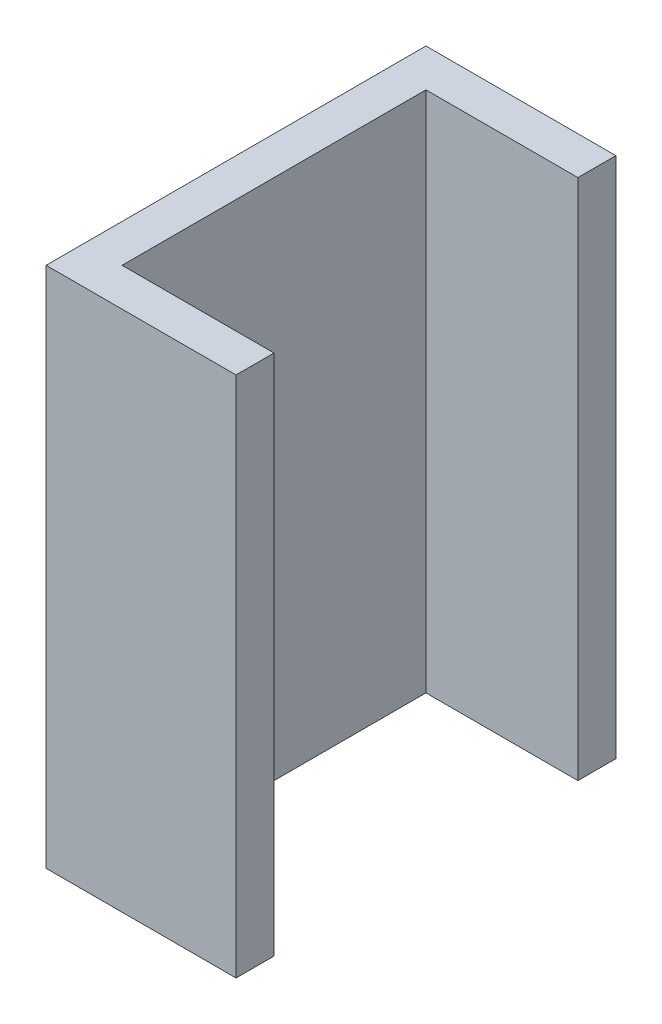
ISO-10303-21;
HEADER;
FILE_DESCRIPTION(('STEP AP214'),'2;1');
FILE_NAME('part.step','',(''),(''),'','','');
FILE_SCHEMA(('AUTOMOTIVE_DESIGN { 1 0 10303 214 1 1 1 1 }'));
ENDSEC;
DATA;
#1=APPLICATION_CONTEXT('core data for automotive mechanical design processes');
#2=APPLICATION_PROTOCOL_DEFINITION('international standard','automotive_design',2000,#1);
#3=PRODUCT_CONTEXT('',#1,'mechanical');
#4=PRODUCT('Part','Part','',(#3));
#5=PRODUCT_RELATED_PRODUCT_CATEGORY('part','',(#4));
#6=PRODUCT_DEFINITION_FORMATION('','',#4);
#7=PRODUCT_DEFINITION_CONTEXT('part definition',#1,'design');
#8=PRODUCT_DEFINITION('design','',#6,#7);
#9=PRODUCT_DEFINITION_SHAPE('','',#8);
#10=(LENGTH_UNIT() NAMED_UNIT(*) SI_UNIT(.MILLI.,.METRE.));
#11=(NAMED_UNIT(*) PLANE_ANGLE_UNIT() SI_UNIT($,.RADIAN.));
#12=(NAMED_UNIT(*) SI_UNIT($,.STERADIAN.) SOLID_ANGLE_UNIT());
#13=UNCERTAINTY_MEASURE_WITH_UNIT(LENGTH_MEASURE(1.E-05),#10,'distance_accuracy_value','');
#14=(GEOMETRIC_REPRESENTATION_CONTEXT(3) GLOBAL_UNCERTAINTY_ASSIGNED_CONTEXT((#13)) GLOBAL_UNIT_ASSIGNED_CONTEXT((#10,
#11,#12)) REPRESENTATION_CONTEXT('',''));
#15=CARTESIAN_POINT('',(0.,0.,0.));
#16=DIRECTION('',(0.,0.,1.));
#17=DIRECTION('',(1.,0.,0.));
#18=AXIS2_PLACEMENT_3D('',#15,#16,#17);
#19=CARTESIAN_POINT('',(0.,0.,0.));
#20=DIRECTION('',(1.,0.,0.));
#21=DIRECTION('',(0.,0.,1.));
#22=AXIS2_PLACEMENT_3D('',#19,#20,#21);
#23=PLANE('',#22);
#24=DIRECTION('',(0.,1.,0.));
#25=VECTOR('',#24,1.);
#26=CARTESIAN_POINT('',(0.,0.,0.4));
#27=LINE('',#26,#25);
#28=CARTESIAN_POINT('',(0.,0.,0.4));
#29=VERTEX_POINT('',#28);
#30=CARTESIAN_POINT('',(0.,0.55,0.4));
#31=VERTEX_POINT('',#30);
#32=EDGE_CURVE('E11',#29,#31,#27,.T.);
#33=ORIENTED_EDGE('',*,*,#32,.T.);
#34=DIRECTION('',(0.,0.,1.));
#35=VECTOR('',#34,1.);
#36=CARTESIAN_POINT('',(0.,0.55,0.));
#37=LINE('',#36,#35);
#38=CARTESIAN_POINT('',(0.,0.55,0.));
#39=VERTEX_POINT('',#38);
#40=EDGE_CURVE('E24',#39,#31,#37,.T.);
#41=ORIENTED_EDGE('',*,*,#40,.F.);
#42=DIRECTION('',(0.,1.,0.));
#43=VECTOR('',#42,1.);
#44=CARTESIAN_POINT('',(0.,0.,0.));
#45=LINE('',#44,#43);
#46=CARTESIAN_POINT('',(0.,0.,0.));
#47=VERTEX_POINT('',#46);
#48=EDGE_CURVE('E144',#47,#39,#45,.T.);
#49=ORIENTED_EDGE('',*,*,#48,.F.);
#50=DIRECTION('',(0.,0.,1.));
#51=VECTOR('',#50,1.);
#52=CARTESIAN_POINT('',(0.,0.,0.));
#53=LINE('',#52,#51);
#54=EDGE_CURVE('E36',#47,#29,#53,.T.);
#55=ORIENTED_EDGE('',*,*,#54,.T.);
#56=EDGE_LOOP('',(#33,#41,#49,#55));
#57=FACE_BOUND('',#56,.T.);
#58=ADVANCED_FACE('F17',(#57),#23,.F.);
#59=CARTESIAN_POINT('',(0.,0.,0.));
#60=DIRECTION('',(0.,1.,0.));
#61=DIRECTION('',(0.,0.,1.));
#62=AXIS2_PLACEMENT_3D('',#59,#60,#61);
#63=PLANE('',#62);
#64=DIRECTION('',(1.,0.,0.));
#65=VECTOR('',#64,1.);
#66=CARTESIAN_POINT('',(0.04,0.,0.04));
#67=LINE('',#66,#65);
#68=CARTESIAN_POINT('',(0.04,0.,0.04));
#69=VERTEX_POINT('',#68);
#70=CARTESIAN_POINT('',(0.2,0.,0.04));
#71=VERTEX_POINT('',#70);
#72=EDGE_CURVE('E141',#69,#71,#67,.T.);
#73=ORIENTED_EDGE('',*,*,#72,.F.);
#74=DIRECTION('',(0.,0.,1.));
#75=VECTOR('',#74,1.);
#76=CARTESIAN_POINT('',(0.04,0.,0.04));
#77=LINE('',#76,#75);
#78=CARTESIAN_POINT('',(0.04,0.,0.36));
#79=VERTEX_POINT('',#78);
#80=EDGE_CURVE('E103',#69,#79,#77,.T.);
#81=ORIENTED_EDGE('',*,*,#80,.T.);
#82=DIRECTION('',(1.,0.,0.));
#83=VECTOR('',#82,1.);
#84=CARTESIAN_POINT('',(0.04,0.,0.36));
#85=LINE('',#84,#83);
#86=CARTESIAN_POINT('',(0.2,0.,0.36));
#87=VERTEX_POINT('',#86);
#88=EDGE_CURVE('E137',#79,#87,#85,.T.);
#89=ORIENTED_EDGE('',*,*,#88,.T.);
#90=DIRECTION('',(0.,0.,1.));
#91=VECTOR('',#90,1.);
#92=CARTESIAN_POINT('',(0.2,0.,0.));
#93=LINE('',#92,#91);
#94=CARTESIAN_POINT('',(0.2,0.,0.4));
#95=VERTEX_POINT('',#94);
#96=EDGE_CURVE('E134',#87,#95,#93,.T.);
#97=ORIENTED_EDGE('',*,*,#96,.T.);
#98=DIRECTION('',(1.,0.,0.));
#99=VECTOR('',#98,1.);
#100=CARTESIAN_POINT('',(0.,0.,0.4));
#101=LINE('',#100,#99);
#102=EDGE_CURVE('E132',#29,#95,#101,.T.);
#103=ORIENTED_EDGE('',*,*,#102,.F.);
#104=ORIENTED_EDGE('',*,*,#54,.F.);
#105=DIRECTION('',(1.,0.,0.));
#106=VECTOR('',#105,1.);
#107=CARTESIAN_POINT('',(0.,0.,0.));
#108=LINE('',#107,#106);
#109=CARTESIAN_POINT('',(0.2,0.,0.));
#110=VERTEX_POINT('',#109);
#111=EDGE_CURVE('E129',#47,#110,#108,.T.);
#112=ORIENTED_EDGE('',*,*,#111,.T.);
#113=DIRECTION('',(0.,0.,1.));
#114=VECTOR('',#113,1.);
#115=CARTESIAN_POINT('',(0.2,0.,0.));
#116=LINE('',#115,#114);
#117=EDGE_CURVE('E127',#110,#71,#116,.T.);
#118=ORIENTED_EDGE('',*,*,#117,.T.);
#119=EDGE_LOOP('',(#73,#81,#89,#97,#103,#104,#112,#118));
#120=FACE_BOUND('',#119,.T.);
#121=ADVANCED_FACE('F153',(#120),#63,.F.);
#122=CARTESIAN_POINT('',(0.,0.,0.4));
#123=DIRECTION('',(0.,0.,1.));
#124=DIRECTION('',(1.,0.,0.));
#125=AXIS2_PLACEMENT_3D('',#122,#123,#124);
#126=PLANE('',#125);
#127=ORIENTED_EDGE('',*,*,#32,.F.);
#128=ORIENTED_EDGE('',*,*,#102,.T.);
#129=DIRECTION('',(0.,1.,0.));
#130=VECTOR('',#129,1.);
#131=CARTESIAN_POINT('',(0.2,0.,0.4));
#132=LINE('',#131,#130);
#133=CARTESIAN_POINT('',(0.2,0.55,0.4));
#134=VERTEX_POINT('',#133);
#135=EDGE_CURVE('E125',#95,#134,#132,.T.);
#136=ORIENTED_EDGE('',*,*,#135,.T.);
#137=DIRECTION('',(1.,0.,0.));
#138=VECTOR('',#137,1.);
#139=CARTESIAN_POINT('',(0.,0.55,0.4));
#140=LINE('',#139,#138);
#141=EDGE_CURVE('E123',#31,#134,#140,.T.);
#142=ORIENTED_EDGE('',*,*,#141,.F.);
#143=EDGE_LOOP('',(#127,#128,#136,#142));
#144=FACE_BOUND('',#143,.T.);
#145=ADVANCED_FACE('F157',(#144),#126,.T.);
#146=CARTESIAN_POINT('',(0.,0.55,0.));
#147=DIRECTION('',(0.,1.,0.));
#148=DIRECTION('',(0.,0.,1.));
#149=AXIS2_PLACEMENT_3D('',#146,#147,#148);
#150=PLANE('',#149);
#151=DIRECTION('',(0.,0.,1.));
#152=VECTOR('',#151,1.);
#153=CARTESIAN_POINT('',(0.2,0.55,0.));
#154=LINE('',#153,#152);
#155=CARTESIAN_POINT('',(0.2,0.55,0.));
#156=VERTEX_POINT('',#155);
#157=CARTESIAN_POINT('',(0.2,0.55,0.04));
#158=VERTEX_POINT('',#157);
#159=EDGE_CURVE('E121',#156,#158,#154,.T.);
#160=ORIENTED_EDGE('',*,*,#159,.F.);
#161=DIRECTION('',(1.,0.,0.));
#162=VECTOR('',#161,1.);
#163=CARTESIAN_POINT('',(0.,0.55,0.));
#164=LINE('',#163,#162);
#165=EDGE_CURVE('E118',#39,#156,#164,.T.);
#166=ORIENTED_EDGE('',*,*,#165,.F.);
#167=ORIENTED_EDGE('',*,*,#40,.T.);
#168=ORIENTED_EDGE('',*,*,#141,.T.);
#169=DIRECTION('',(0.,0.,1.));
#170=VECTOR('',#169,1.);
#171=CARTESIAN_POINT('',(0.2,0.55,0.));
#172=LINE('',#171,#170);
#173=CARTESIAN_POINT('',(0.2,0.55,0.36));
#174=VERTEX_POINT('',#173);
#175=EDGE_CURVE('E115',#174,#134,#172,.T.);
#176=ORIENTED_EDGE('',*,*,#175,.F.);
#177=DIRECTION('',(1.,0.,0.));
#178=VECTOR('',#177,1.);
#179=CARTESIAN_POINT('',(0.04,0.55,0.36));
#180=LINE('',#179,#178);
#181=CARTESIAN_POINT('',(0.04,0.55,0.36));
#182=VERTEX_POINT('',#181);
#183=EDGE_CURVE('E86',#182,#174,#180,.T.);
#184=ORIENTED_EDGE('',*,*,#183,.F.);
#185=DIRECTION('',(0.,0.,1.));
#186=VECTOR('',#185,1.);
#187=CARTESIAN_POINT('',(0.04,0.55,0.04));
#188=LINE('',#187,#186);
#189=CARTESIAN_POINT('',(0.04,0.55,0.04));
#190=VERTEX_POINT('',#189);
#191=EDGE_CURVE('E80',#190,#182,#188,.T.);
#192=ORIENTED_EDGE('',*,*,#191,.F.);
#193=DIRECTION('',(1.,0.,0.));
#194=VECTOR('',#193,1.);
#195=CARTESIAN_POINT('',(0.04,0.55,0.04));
#196=LINE('',#195,#194);
#197=EDGE_CURVE('E83',#190,#158,#196,.T.);
#198=ORIENTED_EDGE('',*,*,#197,.T.);
#199=EDGE_LOOP('',(#160,#166,#167,#168,#176,#184,#192,#198));
#200=FACE_BOUND('',#199,.T.);
#201=ADVANCED_FACE('F82',(#200),#150,.T.);
#202=CARTESIAN_POINT('',(0.,0.,0.));
#203=DIRECTION('',(0.,0.,1.));
#204=DIRECTION('',(1.,0.,0.));
#205=AXIS2_PLACEMENT_3D('',#202,#203,#204);
#206=PLANE('',#205);
#207=ORIENTED_EDGE('',*,*,#165,.T.);
#208=DIRECTION('',(0.,1.,0.));
#209=VECTOR('',#208,1.);
#210=CARTESIAN_POINT('',(0.2,0.,0.));
#211=LINE('',#210,#209);
#212=EDGE_CURVE('E99',#110,#156,#211,.T.);
#213=ORIENTED_EDGE('',*,*,#212,.F.);
#214=ORIENTED_EDGE('',*,*,#111,.F.);
#215=ORIENTED_EDGE('',*,*,#48,.T.);
#216=EDGE_LOOP('',(#207,#213,#214,#215));
#217=FACE_BOUND('',#216,.T.);
#218=ADVANCED_FACE('F147',(#217),#206,.F.);
#219=CARTESIAN_POINT('',(0.2,0.,0.));
#220=DIRECTION('',(1.,0.,0.));
#221=DIRECTION('',(0.,0.,1.));
#222=AXIS2_PLACEMENT_3D('',#219,#220,#221);
#223=PLANE('',#222);
#224=ORIENTED_EDGE('',*,*,#117,.F.);
#225=ORIENTED_EDGE('',*,*,#212,.T.);
#226=ORIENTED_EDGE('',*,*,#159,.T.);
#227=DIRECTION('',(0.,-1.,0.));
#228=VECTOR('',#227,1.);
#229=CARTESIAN_POINT('',(0.2,0.,0.04));
#230=LINE('',#229,#228);
#231=EDGE_CURVE('E98',#158,#71,#230,.T.);
#232=ORIENTED_EDGE('',*,*,#231,.T.);
#233=EDGE_LOOP('',(#224,#225,#226,#232));
#234=FACE_BOUND('',#233,.T.);
#235=ADVANCED_FACE('F151',(#234),#223,.T.);
#236=CARTESIAN_POINT('',(0.04,0.,0.04));
#237=DIRECTION('',(0.,0.,1.));
#238=DIRECTION('',(1.,0.,0.));
#239=AXIS2_PLACEMENT_3D('',#236,#237,#238);
#240=PLANE('',#239);
#241=ORIENTED_EDGE('',*,*,#197,.F.);
#242=DIRECTION('',(0.,1.,0.));
#243=VECTOR('',#242,1.);
#244=CARTESIAN_POINT('',(0.04,0.,0.04));
#245=LINE('',#244,#243);
#246=EDGE_CURVE('E96',#69,#190,#245,.T.);
#247=ORIENTED_EDGE('',*,*,#246,.F.);
#248=ORIENTED_EDGE('',*,*,#72,.T.);
#249=ORIENTED_EDGE('',*,*,#231,.F.);
#250=EDGE_LOOP('',(#241,#247,#248,#249));
#251=FACE_BOUND('',#250,.T.);
#252=ADVANCED_FACE('F94',(#251),#240,.T.);
#253=CARTESIAN_POINT('',(0.04,0.,0.04));
#254=DIRECTION('',(1.,0.,0.));
#255=DIRECTION('',(0.,0.,1.));
#256=AXIS2_PLACEMENT_3D('',#253,#254,#255);
#257=PLANE('',#256);
#258=ORIENTED_EDGE('',*,*,#80,.F.);
#259=ORIENTED_EDGE('',*,*,#246,.T.);
#260=ORIENTED_EDGE('',*,*,#191,.T.);
#261=DIRECTION('',(0.,1.,0.));
#262=VECTOR('',#261,1.);
#263=CARTESIAN_POINT('',(0.04,0.,0.36));
#264=LINE('',#263,#262);
#265=EDGE_CURVE('E105',#79,#182,#264,.T.);
#266=ORIENTED_EDGE('',*,*,#265,.F.);
#267=EDGE_LOOP('',(#258,#259,#260,#266));
#268=FACE_BOUND('',#267,.T.);
#269=ADVANCED_FACE('F101',(#268),#257,.T.);
#270=CARTESIAN_POINT('',(0.04,0.,0.36));
#271=DIRECTION('',(0.,0.,1.));
#272=DIRECTION('',(1.,0.,0.));
#273=AXIS2_PLACEMENT_3D('',#270,#271,#272);
#274=PLANE('',#273);
#275=DIRECTION('',(0.,-1.,0.));
#276=VECTOR('',#275,1.);
#277=CARTESIAN_POINT('',(0.2,0.,0.36));
#278=LINE('',#277,#276);
#279=EDGE_CURVE('E108',#174,#87,#278,.T.);
#280=ORIENTED_EDGE('',*,*,#279,.T.);
#281=ORIENTED_EDGE('',*,*,#88,.F.);
#282=ORIENTED_EDGE('',*,*,#265,.T.);
#283=ORIENTED_EDGE('',*,*,#183,.T.);
#284=EDGE_LOOP('',(#280,#281,#282,#283));
#285=FACE_BOUND('',#284,.T.);
#286=ADVANCED_FACE('F163',(#285),#274,.F.);
#287=CARTESIAN_POINT('',(0.2,0.,0.));
#288=DIRECTION('',(1.,0.,0.));
#289=DIRECTION('',(0.,0.,1.));
#290=AXIS2_PLACEMENT_3D('',#287,#288,#289);
#291=PLANE('',#290);
#292=ORIENTED_EDGE('',*,*,#96,.F.);
#293=ORIENTED_EDGE('',*,*,#279,.F.);
#294=ORIENTED_EDGE('',*,*,#175,.T.);
#295=ORIENTED_EDGE('',*,*,#135,.F.);
#296=EDGE_LOOP('',(#292,#293,#294,#295));
#297=FACE_BOUND('',#296,.T.);
#298=ADVANCED_FACE('F160',(#297),#291,.T.);
#299=CLOSED_SHELL('',(#58,#121,#145,#201,#218,#235,#252,#269,#286,#298));
#300=MANIFOLD_SOLID_BREP('B1',#299);
#301=ADVANCED_BREP_SHAPE_REPRESENTATION('',(#18,#300),#14);
#302=SHAPE_DEFINITION_REPRESENTATION(#9,#301);
ENDSEC;
END-ISO-10303-21;
